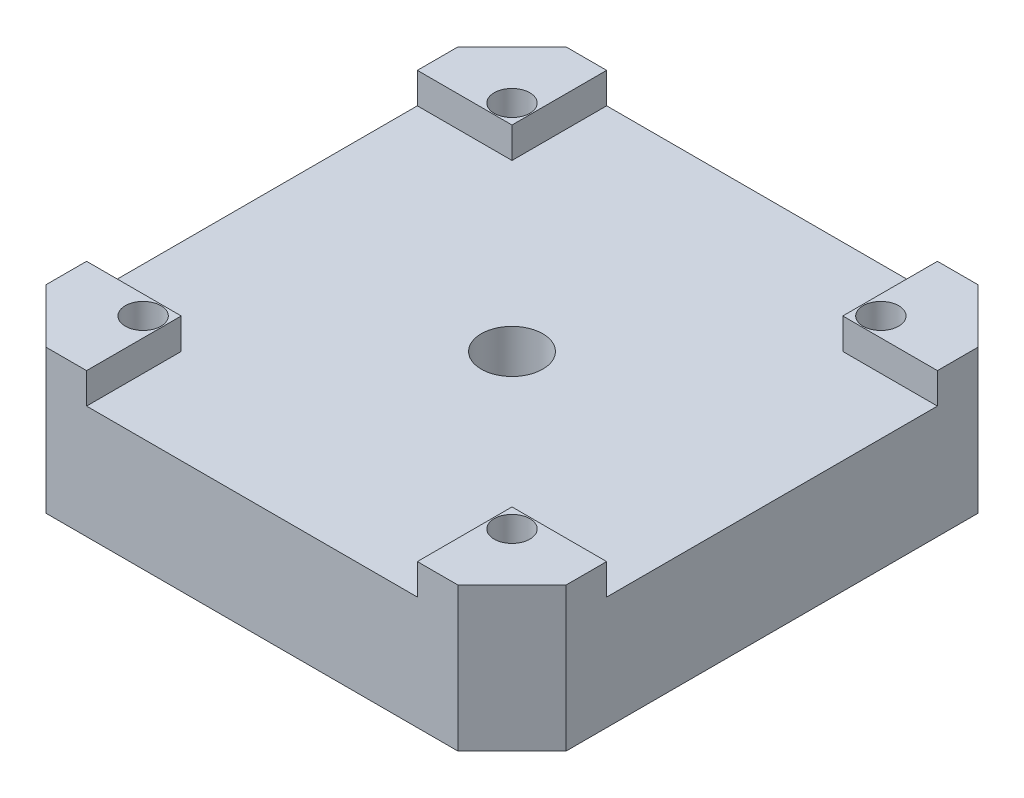
ISO-10303-21;
HEADER;
FILE_DESCRIPTION(('STEP AP214'),'2;1');
FILE_NAME('part.step','',(''),(''),'','','');
FILE_SCHEMA(('AUTOMOTIVE_DESIGN { 1 0 10303 214 1 1 1 1 }'));
ENDSEC;
DATA;
#1=APPLICATION_CONTEXT('core data for automotive mechanical design processes');
#2=APPLICATION_PROTOCOL_DEFINITION('international standard','automotive_design',2000,#1);
#3=PRODUCT_CONTEXT('',#1,'mechanical');
#4=PRODUCT('Part','Part','',(#3));
#5=PRODUCT_RELATED_PRODUCT_CATEGORY('part','',(#4));
#6=PRODUCT_DEFINITION_FORMATION('','',#4);
#7=PRODUCT_DEFINITION_CONTEXT('part definition',#1,'design');
#8=PRODUCT_DEFINITION('design','',#6,#7);
#9=PRODUCT_DEFINITION_SHAPE('','',#8);
#10=(LENGTH_UNIT() NAMED_UNIT(*) SI_UNIT(.MILLI.,.METRE.));
#11=(NAMED_UNIT(*) PLANE_ANGLE_UNIT() SI_UNIT($,.RADIAN.));
#12=(NAMED_UNIT(*) SI_UNIT($,.STERADIAN.) SOLID_ANGLE_UNIT());
#13=UNCERTAINTY_MEASURE_WITH_UNIT(LENGTH_MEASURE(1.E-05),#10,'distance_accuracy_value','');
#14=(GEOMETRIC_REPRESENTATION_CONTEXT(3) GLOBAL_UNCERTAINTY_ASSIGNED_CONTEXT((#13)) GLOBAL_UNIT_ASSIGNED_CONTEXT((#10,
#11,#12)) REPRESENTATION_CONTEXT('',''));
#15=CARTESIAN_POINT('',(0.,0.,0.));
#16=DIRECTION('',(0.,0.,1.));
#17=DIRECTION('',(1.,0.,0.));
#18=AXIS2_PLACEMENT_3D('',#15,#16,#17);
#19=CARTESIAN_POINT('',(0.,11.7,0.));
#20=DIRECTION('',(0.,-1.,0.));
#21=DIRECTION('',(0.,0.,-1.));
#22=AXIS2_PLACEMENT_3D('',#19,#20,#21);
#23=PLANE('',#22);
#24=CARTESIAN_POINT('',(15.,11.7,-15.));
#25=DIRECTION('',(0.,-1.,0.));
#26=DIRECTION('',(0.,0.,-1.));
#27=AXIS2_PLACEMENT_3D('',#24,#25,#26);
#28=CIRCLE('',#27,1.45);
#29=CARTESIAN_POINT('',(15.,11.7,-16.45));
#30=VERTEX_POINT('',#29);
#31=EDGE_CURVE('E365',#30,#30,#28,.T.);
#32=ORIENTED_EDGE('',*,*,#31,.T.);
#33=EDGE_LOOP('',(#32));
#34=FACE_BOUND('',#33,.T.);
#35=DIRECTION('',(-1.,0.,0.));
#36=VECTOR('',#35,1.);
#37=CARTESIAN_POINT('',(-16.750923471599,11.7,-21.15));
#38=LINE('',#37,#36);
#39=CARTESIAN_POINT('',(16.750923471599,11.7,-21.15));
#40=VERTEX_POINT('',#39);
#41=CARTESIAN_POINT('',(13.450923471599,11.7,-21.15));
#42=VERTEX_POINT('',#41);
#43=EDGE_CURVE('E194',#40,#42,#38,.T.);
#44=ORIENTED_EDGE('',*,*,#43,.T.);
#45=DIRECTION('',(0.,0.,1.));
#46=VECTOR('',#45,1.);
#47=CARTESIAN_POINT('',(13.450923471599,11.7,-21.15));
#48=LINE('',#47,#46);
#49=CARTESIAN_POINT('',(13.450923471599,11.7,-13.4509234715989));
#50=VERTEX_POINT('',#49);
#51=EDGE_CURVE('E302',#42,#50,#48,.T.);
#52=ORIENTED_EDGE('',*,*,#51,.T.);
#53=DIRECTION('',(1.,0.,0.));
#54=VECTOR('',#53,1.);
#55=CARTESIAN_POINT('',(-21.15,11.7,-13.4509234715989));
#56=LINE('',#55,#54);
#57=CARTESIAN_POINT('',(21.15,11.7,-13.4509234715989));
#58=VERTEX_POINT('',#57);
#59=EDGE_CURVE('E288',#50,#58,#56,.T.);
#60=ORIENTED_EDGE('',*,*,#59,.T.);
#61=DIRECTION('',(0.,0.,-1.));
#62=VECTOR('',#61,1.);
#63=CARTESIAN_POINT('',(21.15,11.7,16.7509234715989));
#64=LINE('',#63,#62);
#65=CARTESIAN_POINT('',(21.15,11.7,-16.7509234715989));
#66=VERTEX_POINT('',#65);
#67=EDGE_CURVE('E276',#58,#66,#64,.T.);
#68=ORIENTED_EDGE('',*,*,#67,.T.);
#69=DIRECTION('',(-0.707106781186542,0.,-0.707106781186553));
#70=VECTOR('',#69,1.);
#71=CARTESIAN_POINT('',(16.750923471599,11.7,-21.15));
#72=LINE('',#71,#70);
#73=EDGE_CURVE('E195',#66,#40,#72,.T.);
#74=ORIENTED_EDGE('',*,*,#73,.T.);
#75=EDGE_LOOP('',(#44,#52,#60,#68,#74));
#76=FACE_BOUND('',#75,.T.);
#77=ADVANCED_FACE('F35',(#34,#76),#23,.F.);
#78=CARTESIAN_POINT('',(15.,11.7,15.));
#79=DIRECTION('',(0.,-1.,0.));
#80=DIRECTION('',(0.,0.,-1.));
#81=AXIS2_PLACEMENT_3D('',#78,#79,#80);
#82=CIRCLE('',#81,1.45);
#83=CARTESIAN_POINT('',(15.,11.7,13.55));
#84=VERTEX_POINT('',#83);
#85=EDGE_CURVE('E377',#84,#84,#82,.T.);
#86=ORIENTED_EDGE('',*,*,#85,.T.);
#87=EDGE_LOOP('',(#86));
#88=FACE_BOUND('',#87,.T.);
#89=DIRECTION('',(1.,0.,0.));
#90=VECTOR('',#89,1.);
#91=CARTESIAN_POINT('',(-21.15,11.7,13.4509234715989));
#92=LINE('',#91,#90);
#93=CARTESIAN_POINT('',(13.450923471599,11.7,13.4509234715989));
#94=VERTEX_POINT('',#93);
#95=CARTESIAN_POINT('',(21.15,11.7,13.4509234715989));
#96=VERTEX_POINT('',#95);
#97=EDGE_CURVE('E266',#94,#96,#92,.T.);
#98=ORIENTED_EDGE('',*,*,#97,.F.);
#99=CARTESIAN_POINT('',(13.450923471599,11.7,21.15));
#100=VERTEX_POINT('',#99);
#101=EDGE_CURVE('E305',#94,#100,#48,.T.);
#102=ORIENTED_EDGE('',*,*,#101,.T.);
#103=DIRECTION('',(1.,0.,0.));
#104=VECTOR('',#103,1.);
#105=CARTESIAN_POINT('',(-16.750923471599,11.7,21.15));
#106=LINE('',#105,#104);
#107=CARTESIAN_POINT('',(16.750923471599,11.7,21.15));
#108=VERTEX_POINT('',#107);
#109=EDGE_CURVE('E271',#100,#108,#106,.T.);
#110=ORIENTED_EDGE('',*,*,#109,.T.);
#111=DIRECTION('',(0.707106781186546,0.,-0.707106781186549));
#112=VECTOR('',#111,1.);
#113=CARTESIAN_POINT('',(16.750923471599,11.7,21.15));
#114=LINE('',#113,#112);
#115=CARTESIAN_POINT('',(21.15,11.7,16.7509234715989));
#116=VERTEX_POINT('',#115);
#117=EDGE_CURVE('E275',#108,#116,#114,.T.);
#118=ORIENTED_EDGE('',*,*,#117,.T.);
#119=EDGE_CURVE('E199',#116,#96,#64,.T.);
#120=ORIENTED_EDGE('',*,*,#119,.T.);
#121=EDGE_LOOP('',(#98,#102,#110,#118,#120));
#122=FACE_BOUND('',#121,.T.);
#123=ADVANCED_FACE('F438',(#88,#122),#23,.F.);
#124=CARTESIAN_POINT('',(-21.15,9.2,-13.4509234715989));
#125=DIRECTION('',(0.,0.,-1.));
#126=DIRECTION('',(-1.,0.,0.));
#127=AXIS2_PLACEMENT_3D('',#124,#125,#126);
#128=PLANE('',#127);
#129=ORIENTED_EDGE('',*,*,#59,.F.);
#130=DIRECTION('',(0.,-1.,0.));
#131=VECTOR('',#130,1.);
#132=CARTESIAN_POINT('',(13.450923471599,9.20000000000002,-13.4509234715989));
#133=LINE('',#132,#131);
#134=CARTESIAN_POINT('',(13.450923471599,9.2,-13.4509234715989));
#135=VERTEX_POINT('',#134);
#136=EDGE_CURVE('E310',#50,#135,#133,.T.);
#137=ORIENTED_EDGE('',*,*,#136,.T.);
#138=DIRECTION('',(1.,0.,0.));
#139=VECTOR('',#138,1.);
#140=CARTESIAN_POINT('',(-21.15,9.2,-13.4509234715989));
#141=LINE('',#140,#139);
#142=CARTESIAN_POINT('',(21.15,9.2,-13.4509234715989));
#143=VERTEX_POINT('',#142);
#144=EDGE_CURVE('E258',#135,#143,#141,.T.);
#145=ORIENTED_EDGE('',*,*,#144,.T.);
#146=DIRECTION('',(0.,1.,0.));
#147=VECTOR('',#146,1.);
#148=CARTESIAN_POINT('',(21.15,9.2,-13.4509234715989));
#149=LINE('',#148,#147);
#150=EDGE_CURVE('E312',#143,#58,#149,.T.);
#151=ORIENTED_EDGE('',*,*,#150,.T.);
#152=EDGE_LOOP('',(#129,#137,#145,#151));
#153=FACE_BOUND('',#152,.T.);
#154=ADVANCED_FACE('F309',(#153),#128,.F.);
#155=CARTESIAN_POINT('',(-21.15,11.7,13.4509234715989));
#156=DIRECTION('',(0.,0.,1.));
#157=DIRECTION('',(1.,0.,0.));
#158=AXIS2_PLACEMENT_3D('',#155,#156,#157);
#159=PLANE('',#158);
#160=DIRECTION('',(1.,0.,0.));
#161=VECTOR('',#160,1.);
#162=CARTESIAN_POINT('',(-21.15,9.2,13.4509234715989));
#163=LINE('',#162,#161);
#164=CARTESIAN_POINT('',(13.450923471599,9.2,13.4509234715989));
#165=VERTEX_POINT('',#164);
#166=CARTESIAN_POINT('',(21.15,9.2,13.4509234715989));
#167=VERTEX_POINT('',#166);
#168=EDGE_CURVE('E259',#165,#167,#163,.T.);
#169=ORIENTED_EDGE('',*,*,#168,.F.);
#170=DIRECTION('',(0.,1.,0.));
#171=VECTOR('',#170,1.);
#172=CARTESIAN_POINT('',(13.450923471599,11.7,13.4509234715989));
#173=LINE('',#172,#171);
#174=EDGE_CURVE('E11',#165,#94,#173,.T.);
#175=ORIENTED_EDGE('',*,*,#174,.T.);
#176=ORIENTED_EDGE('',*,*,#97,.T.);
#177=DIRECTION('',(0.,-1.,0.));
#178=VECTOR('',#177,1.);
#179=CARTESIAN_POINT('',(21.15,11.7,13.4509234715989));
#180=LINE('',#179,#178);
#181=EDGE_CURVE('E320',#96,#167,#180,.T.);
#182=ORIENTED_EDGE('',*,*,#181,.T.);
#183=EDGE_LOOP('',(#169,#175,#176,#182));
#184=FACE_BOUND('',#183,.T.);
#185=ADVANCED_FACE('F448',(#184),#159,.F.);
#186=CARTESIAN_POINT('',(-15.,11.7,-15.));
#187=DIRECTION('',(0.,-1.,0.));
#188=DIRECTION('',(0.,0.,-1.));
#189=AXIS2_PLACEMENT_3D('',#186,#187,#188);
#190=CIRCLE('',#189,1.45);
#191=CARTESIAN_POINT('',(-15.,11.7,-16.45));
#192=VERTEX_POINT('',#191);
#193=EDGE_CURVE('E353',#192,#192,#190,.T.);
#194=ORIENTED_EDGE('',*,*,#193,.T.);
#195=EDGE_LOOP('',(#194));
#196=FACE_BOUND('',#195,.T.);
#197=CARTESIAN_POINT('',(-21.15,11.7,-13.4509234715989));
#198=VERTEX_POINT('',#197);
#199=CARTESIAN_POINT('',(-13.450923471599,11.7,-13.4509234715989));
#200=VERTEX_POINT('',#199);
#201=EDGE_CURVE('E187',#198,#200,#56,.T.);
#202=ORIENTED_EDGE('',*,*,#201,.T.);
#203=DIRECTION('',(0.,0.,1.));
#204=VECTOR('',#203,1.);
#205=CARTESIAN_POINT('',(-13.450923471599,11.7,-21.15));
#206=LINE('',#205,#204);
#207=CARTESIAN_POINT('',(-13.450923471599,11.7,-21.15));
#208=VERTEX_POINT('',#207);
#209=EDGE_CURVE('E50',#208,#200,#206,.T.);
#210=ORIENTED_EDGE('',*,*,#209,.F.);
#211=CARTESIAN_POINT('',(-16.750923471599,11.7,-21.15));
#212=VERTEX_POINT('',#211);
#213=EDGE_CURVE('E184',#208,#212,#38,.T.);
#214=ORIENTED_EDGE('',*,*,#213,.T.);
#215=DIRECTION('',(-0.707106781186546,0.,0.707106781186549));
#216=VECTOR('',#215,1.);
#217=CARTESIAN_POINT('',(-21.15,11.7,-16.7509234715989));
#218=LINE('',#217,#216);
#219=CARTESIAN_POINT('',(-21.15,11.7,-16.7509234715989));
#220=VERTEX_POINT('',#219);
#221=EDGE_CURVE('E198',#212,#220,#218,.T.);
#222=ORIENTED_EDGE('',*,*,#221,.T.);
#223=DIRECTION('',(0.,0.,1.));
#224=VECTOR('',#223,1.);
#225=CARTESIAN_POINT('',(-21.15,11.7,16.7509234715989));
#226=LINE('',#225,#224);
#227=EDGE_CURVE('E267',#220,#198,#226,.T.);
#228=ORIENTED_EDGE('',*,*,#227,.T.);
#229=EDGE_LOOP('',(#202,#210,#214,#222,#228));
#230=FACE_BOUND('',#229,.T.);
#231=ADVANCED_FACE('F183',(#196,#230),#23,.F.);
#232=CARTESIAN_POINT('',(-21.15,11.7,16.7509234715989));
#233=DIRECTION('',(1.,0.,0.));
#234=DIRECTION('',(0.,0.,-1.));
#235=AXIS2_PLACEMENT_3D('',#232,#233,#234);
#236=PLANE('',#235);
#237=DIRECTION('',(0.,0.,-1.));
#238=VECTOR('',#237,1.);
#239=CARTESIAN_POINT('',(-21.15,9.2,13.4509234715989));
#240=LINE('',#239,#238);
#241=CARTESIAN_POINT('',(-21.15,9.2,13.4509234715989));
#242=VERTEX_POINT('',#241);
#243=CARTESIAN_POINT('',(-21.15,9.2,-13.4509234715989));
#244=VERTEX_POINT('',#243);
#245=EDGE_CURVE('E256',#242,#244,#240,.T.);
#246=ORIENTED_EDGE('',*,*,#245,.T.);
#247=DIRECTION('',(0.,1.,0.));
#248=VECTOR('',#247,1.);
#249=CARTESIAN_POINT('',(-21.15,9.2,-13.4509234715989));
#250=LINE('',#249,#248);
#251=EDGE_CURVE('E323',#244,#198,#250,.T.);
#252=ORIENTED_EDGE('',*,*,#251,.T.);
#253=ORIENTED_EDGE('',*,*,#227,.F.);
#254=DIRECTION('',(0.,-1.,0.));
#255=VECTOR('',#254,1.);
#256=CARTESIAN_POINT('',(-21.15,11.7,-16.7509234715989));
#257=LINE('',#256,#255);
#258=CARTESIAN_POINT('',(-21.15,0.,-16.7509234715989));
#259=VERTEX_POINT('',#258);
#260=EDGE_CURVE('E204',#220,#259,#257,.T.);
#261=ORIENTED_EDGE('',*,*,#260,.T.);
#262=DIRECTION('',(0.,0.,1.));
#263=VECTOR('',#262,1.);
#264=CARTESIAN_POINT('',(-21.15,0.,16.7509234715989));
#265=LINE('',#264,#263);
#266=CARTESIAN_POINT('',(-21.15,0.,16.7509234715989));
#267=VERTEX_POINT('',#266);
#268=EDGE_CURVE('E205',#259,#267,#265,.T.);
#269=ORIENTED_EDGE('',*,*,#268,.T.);
#270=DIRECTION('',(0.,-1.,0.));
#271=VECTOR('',#270,1.);
#272=CARTESIAN_POINT('',(-21.15,11.7,16.7509234715989));
#273=LINE('',#272,#271);
#274=CARTESIAN_POINT('',(-21.15,11.7,16.7509234715989));
#275=VERTEX_POINT('',#274);
#276=EDGE_CURVE('E241',#275,#267,#273,.T.);
#277=ORIENTED_EDGE('',*,*,#276,.F.);
#278=CARTESIAN_POINT('',(-21.15,11.7,13.4509234715989));
#279=VERTEX_POINT('',#278);
#280=EDGE_CURVE('E222',#279,#275,#226,.T.);
#281=ORIENTED_EDGE('',*,*,#280,.F.);
#282=DIRECTION('',(0.,-1.,0.));
#283=VECTOR('',#282,1.);
#284=CARTESIAN_POINT('',(-21.15,11.7,13.4509234715989));
#285=LINE('',#284,#283);
#286=EDGE_CURVE('E316',#279,#242,#285,.T.);
#287=ORIENTED_EDGE('',*,*,#286,.T.);
#288=EDGE_LOOP('',(#246,#252,#253,#261,#269,#277,#281,#287));
#289=FACE_BOUND('',#288,.T.);
#290=ADVANCED_FACE('F37',(#289),#236,.F.);
#291=CARTESIAN_POINT('',(-21.15,11.7,16.7509234715989));
#292=DIRECTION('',(0.707106781186553,0.,-0.707106781186542));
#293=DIRECTION('',(-0.707106781186542,0.,-0.707106781186553));
#294=AXIS2_PLACEMENT_3D('',#291,#292,#293);
#295=PLANE('',#294);
#296=DIRECTION('',(0.707106781186542,0.,0.707106781186553));
#297=VECTOR('',#296,1.);
#298=CARTESIAN_POINT('',(-21.15,0.,16.7509234715989));
#299=LINE('',#298,#297);
#300=CARTESIAN_POINT('',(-16.750923471599,0.,21.15));
#301=VERTEX_POINT('',#300);
#302=EDGE_CURVE('E208',#267,#301,#299,.T.);
#303=ORIENTED_EDGE('',*,*,#302,.T.);
#304=DIRECTION('',(0.,-1.,0.));
#305=VECTOR('',#304,1.);
#306=CARTESIAN_POINT('',(-16.750923471599,11.7,21.15));
#307=LINE('',#306,#305);
#308=CARTESIAN_POINT('',(-16.750923471599,11.7,21.15));
#309=VERTEX_POINT('',#308);
#310=EDGE_CURVE('E238',#309,#301,#307,.T.);
#311=ORIENTED_EDGE('',*,*,#310,.F.);
#312=DIRECTION('',(0.707106781186542,0.,0.707106781186553));
#313=VECTOR('',#312,1.);
#314=CARTESIAN_POINT('',(-21.15,11.7,16.7509234715989));
#315=LINE('',#314,#313);
#316=EDGE_CURVE('E269',#275,#309,#315,.T.);
#317=ORIENTED_EDGE('',*,*,#316,.F.);
#318=ORIENTED_EDGE('',*,*,#276,.T.);
#319=EDGE_LOOP('',(#303,#311,#317,#318));
#320=FACE_BOUND('',#319,.T.);
#321=ADVANCED_FACE('F721',(#320),#295,.F.);
#322=CARTESIAN_POINT('',(-16.750923471599,11.7,21.15));
#323=DIRECTION('',(0.,0.,-1.));
#324=DIRECTION('',(-1.,0.,0.));
#325=AXIS2_PLACEMENT_3D('',#322,#323,#324);
#326=PLANE('',#325);
#327=ORIENTED_EDGE('',*,*,#109,.F.);
#328=DIRECTION('',(0.,1.,0.));
#329=VECTOR('',#328,1.);
#330=CARTESIAN_POINT('',(13.450923471599,9.2,21.15));
#331=LINE('',#330,#329);
#332=CARTESIAN_POINT('',(13.450923471599,9.2,21.15));
#333=VERTEX_POINT('',#332);
#334=EDGE_CURVE('E179',#333,#100,#331,.T.);
#335=ORIENTED_EDGE('',*,*,#334,.F.);
#336=DIRECTION('',(1.,0.,0.));
#337=VECTOR('',#336,1.);
#338=CARTESIAN_POINT('',(-13.450923471599,9.2,21.15));
#339=LINE('',#338,#337);
#340=CARTESIAN_POINT('',(-13.450923471599,9.2,21.15));
#341=VERTEX_POINT('',#340);
#342=EDGE_CURVE('E335',#341,#333,#339,.T.);
#343=ORIENTED_EDGE('',*,*,#342,.F.);
#344=DIRECTION('',(0.,-1.,0.));
#345=VECTOR('',#344,1.);
#346=CARTESIAN_POINT('',(-13.450923471599,11.7,21.15));
#347=LINE('',#346,#345);
#348=CARTESIAN_POINT('',(-13.450923471599,11.7,21.15));
#349=VERTEX_POINT('',#348);
#350=EDGE_CURVE('E337',#349,#341,#347,.T.);
#351=ORIENTED_EDGE('',*,*,#350,.F.);
#352=EDGE_CURVE('E272',#309,#349,#106,.T.);
#353=ORIENTED_EDGE('',*,*,#352,.F.);
#354=ORIENTED_EDGE('',*,*,#310,.T.);
#355=DIRECTION('',(1.,0.,0.));
#356=VECTOR('',#355,1.);
#357=CARTESIAN_POINT('',(-16.750923471599,0.,21.15));
#358=LINE('',#357,#356);
#359=CARTESIAN_POINT('',(16.750923471599,0.,21.15));
#360=VERTEX_POINT('',#359);
#361=EDGE_CURVE('E210',#301,#360,#358,.T.);
#362=ORIENTED_EDGE('',*,*,#361,.T.);
#363=DIRECTION('',(0.,-1.,0.));
#364=VECTOR('',#363,1.);
#365=CARTESIAN_POINT('',(16.750923471599,11.7,21.15));
#366=LINE('',#365,#364);
#367=EDGE_CURVE('E235',#108,#360,#366,.T.);
#368=ORIENTED_EDGE('',*,*,#367,.F.);
#369=EDGE_LOOP('',(#327,#335,#343,#351,#353,#354,#362,#368));
#370=FACE_BOUND('',#369,.T.);
#371=ADVANCED_FACE('F740',(#370),#326,.F.);
#372=CARTESIAN_POINT('',(16.750923471599,11.7,21.15));
#373=DIRECTION('',(-0.707106781186549,0.,-0.707106781186546));
#374=DIRECTION('',(-0.707106781186546,0.,0.707106781186549));
#375=AXIS2_PLACEMENT_3D('',#372,#373,#374);
#376=PLANE('',#375);
#377=DIRECTION('',(0.707106781186546,0.,-0.707106781186549));
#378=VECTOR('',#377,1.);
#379=CARTESIAN_POINT('',(16.750923471599,0.,21.15));
#380=LINE('',#379,#378);
#381=CARTESIAN_POINT('',(21.15,0.,16.7509234715989));
#382=VERTEX_POINT('',#381);
#383=EDGE_CURVE('E212',#360,#382,#380,.T.);
#384=ORIENTED_EDGE('',*,*,#383,.T.);
#385=DIRECTION('',(0.,-1.,0.));
#386=VECTOR('',#385,1.);
#387=CARTESIAN_POINT('',(21.15,11.7,16.7509234715989));
#388=LINE('',#387,#386);
#389=EDGE_CURVE('E232',#116,#382,#388,.T.);
#390=ORIENTED_EDGE('',*,*,#389,.F.);
#391=ORIENTED_EDGE('',*,*,#117,.F.);
#392=ORIENTED_EDGE('',*,*,#367,.T.);
#393=EDGE_LOOP('',(#384,#390,#391,#392));
#394=FACE_BOUND('',#393,.T.);
#395=ADVANCED_FACE('F710',(#394),#376,.F.);
#396=CARTESIAN_POINT('',(21.15,11.7,16.7509234715989));
#397=DIRECTION('',(-1.,0.,0.));
#398=DIRECTION('',(0.,0.,1.));
#399=AXIS2_PLACEMENT_3D('',#396,#397,#398);
#400=PLANE('',#399);
#401=ORIENTED_EDGE('',*,*,#67,.F.);
#402=ORIENTED_EDGE('',*,*,#150,.F.);
#403=DIRECTION('',(0.,0.,-1.));
#404=VECTOR('',#403,1.);
#405=CARTESIAN_POINT('',(21.15,9.2,13.4509234715989));
#406=LINE('',#405,#404);
#407=EDGE_CURVE('E317',#167,#143,#406,.T.);
#408=ORIENTED_EDGE('',*,*,#407,.F.);
#409=ORIENTED_EDGE('',*,*,#181,.F.);
#410=ORIENTED_EDGE('',*,*,#119,.F.);
#411=ORIENTED_EDGE('',*,*,#389,.T.);
#412=DIRECTION('',(0.,0.,-1.));
#413=VECTOR('',#412,1.);
#414=CARTESIAN_POINT('',(21.15,0.,16.7509234715989));
#415=LINE('',#414,#413);
#416=CARTESIAN_POINT('',(21.15,0.,-16.7509234715989));
#417=VERTEX_POINT('',#416);
#418=EDGE_CURVE('E214',#382,#417,#415,.T.);
#419=ORIENTED_EDGE('',*,*,#418,.T.);
#420=DIRECTION('',(0.,-1.,0.));
#421=VECTOR('',#420,1.);
#422=CARTESIAN_POINT('',(21.15,11.7,-16.7509234715989));
#423=LINE('',#422,#421);
#424=EDGE_CURVE('E229',#66,#417,#423,.T.);
#425=ORIENTED_EDGE('',*,*,#424,.F.);
#426=EDGE_LOOP('',(#401,#402,#408,#409,#410,#411,#419,#425));
#427=FACE_BOUND('',#426,.T.);
#428=ADVANCED_FACE('F292',(#427),#400,.F.);
#429=CARTESIAN_POINT('',(16.750923471599,11.7,-21.15));
#430=DIRECTION('',(-0.707106781186553,0.,0.707106781186542));
#431=DIRECTION('',(0.707106781186542,0.,0.707106781186553));
#432=AXIS2_PLACEMENT_3D('',#429,#430,#431);
#433=PLANE('',#432);
#434=DIRECTION('',(-0.707106781186542,0.,-0.707106781186553));
#435=VECTOR('',#434,1.);
#436=CARTESIAN_POINT('',(16.750923471599,0.,-21.15));
#437=LINE('',#436,#435);
#438=CARTESIAN_POINT('',(16.750923471599,0.,-21.15));
#439=VERTEX_POINT('',#438);
#440=EDGE_CURVE('E216',#417,#439,#437,.T.);
#441=ORIENTED_EDGE('',*,*,#440,.T.);
#442=DIRECTION('',(0.,-1.,0.));
#443=VECTOR('',#442,1.);
#444=CARTESIAN_POINT('',(16.750923471599,11.7,-21.15));
#445=LINE('',#444,#443);
#446=EDGE_CURVE('E226',#40,#439,#445,.T.);
#447=ORIENTED_EDGE('',*,*,#446,.F.);
#448=ORIENTED_EDGE('',*,*,#73,.F.);
#449=ORIENTED_EDGE('',*,*,#424,.T.);
#450=EDGE_LOOP('',(#441,#447,#448,#449));
#451=FACE_BOUND('',#450,.T.);
#452=ADVANCED_FACE('F296',(#451),#433,.F.);
#453=CARTESIAN_POINT('',(-16.750923471599,11.7,-21.15));
#454=DIRECTION('',(0.,0.,1.));
#455=DIRECTION('',(1.,0.,0.));
#456=AXIS2_PLACEMENT_3D('',#453,#454,#455);
#457=PLANE('',#456);
#458=DIRECTION('',(1.,0.,0.));
#459=VECTOR('',#458,1.);
#460=CARTESIAN_POINT('',(-13.450923471599,9.2,-21.15));
#461=LINE('',#460,#459);
#462=CARTESIAN_POINT('',(-13.450923471599,9.2,-21.15));
#463=VERTEX_POINT('',#462);
#464=CARTESIAN_POINT('',(13.450923471599,9.2,-21.15));
#465=VERTEX_POINT('',#464);
#466=EDGE_CURVE('E178',#463,#465,#461,.T.);
#467=ORIENTED_EDGE('',*,*,#466,.T.);
#468=DIRECTION('',(0.,1.,0.));
#469=VECTOR('',#468,1.);
#470=CARTESIAN_POINT('',(13.450923471599,9.2,-21.15));
#471=LINE('',#470,#469);
#472=EDGE_CURVE('E301',#465,#42,#471,.T.);
#473=ORIENTED_EDGE('',*,*,#472,.T.);
#474=ORIENTED_EDGE('',*,*,#43,.F.);
#475=ORIENTED_EDGE('',*,*,#446,.T.);
#476=DIRECTION('',(-1.,0.,0.));
#477=VECTOR('',#476,1.);
#478=CARTESIAN_POINT('',(-16.750923471599,0.,-21.15));
#479=LINE('',#478,#477);
#480=CARTESIAN_POINT('',(-16.750923471599,0.,-21.15));
#481=VERTEX_POINT('',#480);
#482=EDGE_CURVE('E218',#439,#481,#479,.T.);
#483=ORIENTED_EDGE('',*,*,#482,.T.);
#484=DIRECTION('',(0.,-1.,0.));
#485=VECTOR('',#484,1.);
#486=CARTESIAN_POINT('',(-16.750923471599,11.7,-21.15));
#487=LINE('',#486,#485);
#488=EDGE_CURVE('E192',#212,#481,#487,.T.);
#489=ORIENTED_EDGE('',*,*,#488,.F.);
#490=ORIENTED_EDGE('',*,*,#213,.F.);
#491=DIRECTION('',(0.,-1.,0.));
#492=VECTOR('',#491,1.);
#493=CARTESIAN_POINT('',(-13.450923471599,11.7,-21.15));
#494=LINE('',#493,#492);
#495=EDGE_CURVE('E170',#208,#463,#494,.T.);
#496=ORIENTED_EDGE('',*,*,#495,.T.);
#497=EDGE_LOOP('',(#467,#473,#474,#475,#483,#489,#490,#496));
#498=FACE_BOUND('',#497,.T.);
#499=ADVANCED_FACE('F190',(#498),#457,.F.);
#500=CARTESIAN_POINT('',(-21.15,11.7,-16.7509234715989));
#501=DIRECTION('',(0.707106781186549,0.,0.707106781186546));
#502=DIRECTION('',(0.707106781186546,0.,-0.707106781186549));
#503=AXIS2_PLACEMENT_3D('',#500,#501,#502);
#504=PLANE('',#503);
#505=DIRECTION('',(-0.707106781186546,0.,0.707106781186549));
#506=VECTOR('',#505,1.);
#507=CARTESIAN_POINT('',(-21.15,0.,-16.7509234715989));
#508=LINE('',#507,#506);
#509=EDGE_CURVE('E220',#481,#259,#508,.T.);
#510=ORIENTED_EDGE('',*,*,#509,.T.);
#511=ORIENTED_EDGE('',*,*,#260,.F.);
#512=ORIENTED_EDGE('',*,*,#221,.F.);
#513=ORIENTED_EDGE('',*,*,#488,.T.);
#514=EDGE_LOOP('',(#510,#511,#512,#513));
#515=FACE_BOUND('',#514,.T.);
#516=ADVANCED_FACE('F427',(#515),#504,.F.);
#517=CARTESIAN_POINT('',(-15.,11.7,15.));
#518=DIRECTION('',(0.,-1.,0.));
#519=DIRECTION('',(0.,0.,-1.));
#520=AXIS2_PLACEMENT_3D('',#517,#518,#519);
#521=CIRCLE('',#520,1.45);
#522=CARTESIAN_POINT('',(-15.,11.7,13.55));
#523=VERTEX_POINT('',#522);
#524=EDGE_CURVE('E389',#523,#523,#521,.T.);
#525=ORIENTED_EDGE('',*,*,#524,.T.);
#526=EDGE_LOOP('',(#525));
#527=FACE_BOUND('',#526,.T.);
#528=ORIENTED_EDGE('',*,*,#352,.T.);
#529=CARTESIAN_POINT('',(-13.450923471599,11.7,13.4509234715989));
#530=VERTEX_POINT('',#529);
#531=EDGE_CURVE('E188',#530,#349,#206,.T.);
#532=ORIENTED_EDGE('',*,*,#531,.F.);
#533=EDGE_CURVE('E250',#279,#530,#92,.T.);
#534=ORIENTED_EDGE('',*,*,#533,.F.);
#535=ORIENTED_EDGE('',*,*,#280,.T.);
#536=ORIENTED_EDGE('',*,*,#316,.T.);
#537=EDGE_LOOP('',(#528,#532,#534,#535,#536));
#538=FACE_BOUND('',#537,.T.);
#539=ADVANCED_FACE('F408',(#527,#538),#23,.F.);
#540=CARTESIAN_POINT('',(0.,0.,0.));
#541=DIRECTION('',(0.,-1.,0.));
#542=DIRECTION('',(0.,0.,-1.));
#543=AXIS2_PLACEMENT_3D('',#540,#541,#542);
#544=PLANE('',#543);
#545=CARTESIAN_POINT('',(-15.,0.,15.));
#546=DIRECTION('',(0.,-1.,0.));
#547=DIRECTION('',(0.,0.,-1.));
#548=AXIS2_PLACEMENT_3D('',#545,#546,#547);
#549=CIRCLE('',#548,3.);
#550=CARTESIAN_POINT('',(-15.,0.,12.));
#551=VERTEX_POINT('',#550);
#552=EDGE_CURVE('E398',#551,#551,#549,.T.);
#553=ORIENTED_EDGE('',*,*,#552,.F.);
#554=EDGE_LOOP('',(#553));
#555=FACE_BOUND('',#554,.T.);
#556=CARTESIAN_POINT('',(15.,0.,15.));
#557=DIRECTION('',(0.,-1.,0.));
#558=DIRECTION('',(0.,0.,-1.));
#559=AXIS2_PLACEMENT_3D('',#556,#557,#558);
#560=CIRCLE('',#559,3.);
#561=CARTESIAN_POINT('',(15.,0.,12.));
#562=VERTEX_POINT('',#561);
#563=EDGE_CURVE('E386',#562,#562,#560,.T.);
#564=ORIENTED_EDGE('',*,*,#563,.F.);
#565=EDGE_LOOP('',(#564));
#566=FACE_BOUND('',#565,.T.);
#567=CARTESIAN_POINT('',(15.,0.,-15.));
#568=DIRECTION('',(0.,-1.,0.));
#569=DIRECTION('',(0.,0.,-1.));
#570=AXIS2_PLACEMENT_3D('',#567,#568,#569);
#571=CIRCLE('',#570,3.);
#572=CARTESIAN_POINT('',(15.,0.,-18.));
#573=VERTEX_POINT('',#572);
#574=EDGE_CURVE('E374',#573,#573,#571,.T.);
#575=ORIENTED_EDGE('',*,*,#574,.F.);
#576=EDGE_LOOP('',(#575));
#577=FACE_BOUND('',#576,.T.);
#578=CARTESIAN_POINT('',(-15.,0.,-15.));
#579=DIRECTION('',(0.,-1.,0.));
#580=DIRECTION('',(0.,0.,-1.));
#581=AXIS2_PLACEMENT_3D('',#578,#579,#580);
#582=CIRCLE('',#581,3.);
#583=CARTESIAN_POINT('',(-15.,0.,-18.));
#584=VERTEX_POINT('',#583);
#585=EDGE_CURVE('E362',#584,#584,#582,.T.);
#586=ORIENTED_EDGE('',*,*,#585,.F.);
#587=EDGE_LOOP('',(#586));
#588=FACE_BOUND('',#587,.T.);
#589=CARTESIAN_POINT('',(0.,0.,0.));
#590=DIRECTION('',(0.,-1.,0.));
#591=DIRECTION('',(0.,0.,-1.));
#592=AXIS2_PLACEMENT_3D('',#589,#590,#591);
#593=CIRCLE('',#592,3.25);
#594=CARTESIAN_POINT('',(0.,0.,-3.25));
#595=VERTEX_POINT('',#594);
#596=EDGE_CURVE('E342',#595,#595,#593,.T.);
#597=ORIENTED_EDGE('',*,*,#596,.F.);
#598=EDGE_LOOP('',(#597));
#599=FACE_BOUND('',#598,.T.);
#600=ORIENTED_EDGE('',*,*,#268,.F.);
#601=ORIENTED_EDGE('',*,*,#509,.F.);
#602=ORIENTED_EDGE('',*,*,#482,.F.);
#603=ORIENTED_EDGE('',*,*,#440,.F.);
#604=ORIENTED_EDGE('',*,*,#418,.F.);
#605=ORIENTED_EDGE('',*,*,#383,.F.);
#606=ORIENTED_EDGE('',*,*,#361,.F.);
#607=ORIENTED_EDGE('',*,*,#302,.F.);
#608=EDGE_LOOP('',(#600,#601,#602,#603,#604,#605,#606,#607));
#609=FACE_BOUND('',#608,.T.);
#610=ADVANCED_FACE('F404',(#555,#566,#577,#588,#599,#609),#544,.T.);
#611=CARTESIAN_POINT('',(-13.450923471599,9.2,-13.4509234715989));
#612=VERTEX_POINT('',#611);
#613=EDGE_CURVE('E261',#244,#612,#141,.T.);
#614=ORIENTED_EDGE('',*,*,#613,.T.);
#615=DIRECTION('',(0.,1.,0.));
#616=VECTOR('',#615,1.);
#617=CARTESIAN_POINT('',(-13.450923471599,9.2,-13.4509234715989));
#618=LINE('',#617,#616);
#619=EDGE_CURVE('E304',#612,#200,#618,.T.);
#620=ORIENTED_EDGE('',*,*,#619,.T.);
#621=ORIENTED_EDGE('',*,*,#201,.F.);
#622=ORIENTED_EDGE('',*,*,#251,.F.);
#623=EDGE_LOOP('',(#614,#620,#621,#622));
#624=FACE_BOUND('',#623,.T.);
#625=ADVANCED_FACE('F407',(#624),#128,.F.);
#626=CARTESIAN_POINT('',(-21.15,9.2,13.4509234715989));
#627=DIRECTION('',(0.,-1.,0.));
#628=DIRECTION('',(0.,0.,-1.));
#629=AXIS2_PLACEMENT_3D('',#626,#627,#628);
#630=PLANE('',#629);
#631=CARTESIAN_POINT('',(0.,9.2,0.));
#632=DIRECTION('',(0.,-1.,0.));
#633=DIRECTION('',(0.,0.,-1.));
#634=AXIS2_PLACEMENT_3D('',#631,#632,#633);
#635=CIRCLE('',#634,2.5);
#636=CARTESIAN_POINT('',(0.,9.2,-2.5));
#637=VERTEX_POINT('',#636);
#638=EDGE_CURVE('E345',#637,#637,#635,.T.);
#639=ORIENTED_EDGE('',*,*,#638,.T.);
#640=EDGE_LOOP('',(#639));
#641=FACE_BOUND('',#640,.T.);
#642=CARTESIAN_POINT('',(-13.450923471599,9.2,13.4509234715989));
#643=VERTEX_POINT('',#642);
#644=EDGE_CURVE('E247',#242,#643,#163,.T.);
#645=ORIENTED_EDGE('',*,*,#644,.T.);
#646=DIRECTION('',(0.,0.,1.));
#647=VECTOR('',#646,1.);
#648=CARTESIAN_POINT('',(-13.450923471599,9.2,-21.15));
#649=LINE('',#648,#647);
#650=EDGE_CURVE('E58',#643,#341,#649,.T.);
#651=ORIENTED_EDGE('',*,*,#650,.T.);
#652=ORIENTED_EDGE('',*,*,#342,.T.);
#653=DIRECTION('',(0.,0.,1.));
#654=VECTOR('',#653,1.);
#655=CARTESIAN_POINT('',(13.450923471599,9.2,-21.15));
#656=LINE('',#655,#654);
#657=EDGE_CURVE('E331',#165,#333,#656,.T.);
#658=ORIENTED_EDGE('',*,*,#657,.F.);
#659=ORIENTED_EDGE('',*,*,#168,.T.);
#660=ORIENTED_EDGE('',*,*,#407,.T.);
#661=ORIENTED_EDGE('',*,*,#144,.F.);
#662=EDGE_CURVE('E332',#465,#135,#656,.T.);
#663=ORIENTED_EDGE('',*,*,#662,.F.);
#664=ORIENTED_EDGE('',*,*,#466,.F.);
#665=EDGE_CURVE('E173',#463,#612,#649,.T.);
#666=ORIENTED_EDGE('',*,*,#665,.T.);
#667=ORIENTED_EDGE('',*,*,#613,.F.);
#668=ORIENTED_EDGE('',*,*,#245,.F.);
#669=EDGE_LOOP('',(#645,#651,#652,#658,#659,#660,#661,#663,#664,#666,#667,#668));
#670=FACE_BOUND('',#669,.T.);
#671=ADVANCED_FACE('F253',(#641,#670),#630,.F.);
#672=ORIENTED_EDGE('',*,*,#533,.T.);
#673=DIRECTION('',(0.,-1.,0.));
#674=VECTOR('',#673,1.);
#675=CARTESIAN_POINT('',(-13.450923471599,11.7,13.4509234715989));
#676=LINE('',#675,#674);
#677=EDGE_CURVE('E43',#530,#643,#676,.T.);
#678=ORIENTED_EDGE('',*,*,#677,.T.);
#679=ORIENTED_EDGE('',*,*,#644,.F.);
#680=ORIENTED_EDGE('',*,*,#286,.F.);
#681=EDGE_LOOP('',(#672,#678,#679,#680));
#682=FACE_BOUND('',#681,.T.);
#683=ADVANCED_FACE('F246',(#682),#159,.F.);
#684=CARTESIAN_POINT('',(-13.450923471599,11.7,-21.15));
#685=DIRECTION('',(-1.,0.,0.));
#686=DIRECTION('',(0.,0.,1.));
#687=AXIS2_PLACEMENT_3D('',#684,#685,#686);
#688=PLANE('',#687);
#689=ORIENTED_EDGE('',*,*,#531,.T.);
#690=ORIENTED_EDGE('',*,*,#350,.T.);
#691=ORIENTED_EDGE('',*,*,#650,.F.);
#692=ORIENTED_EDGE('',*,*,#677,.F.);
#693=EDGE_LOOP('',(#689,#690,#691,#692));
#694=FACE_BOUND('',#693,.T.);
#695=ADVANCED_FACE('F447',(#694),#688,.F.);
#696=CARTESIAN_POINT('',(13.450923471599,9.2,-21.15));
#697=DIRECTION('',(1.,0.,0.));
#698=DIRECTION('',(0.,1.,0.));
#699=AXIS2_PLACEMENT_3D('',#696,#697,#698);
#700=PLANE('',#699);
#701=ORIENTED_EDGE('',*,*,#657,.T.);
#702=ORIENTED_EDGE('',*,*,#334,.T.);
#703=ORIENTED_EDGE('',*,*,#101,.F.);
#704=ORIENTED_EDGE('',*,*,#174,.F.);
#705=EDGE_LOOP('',(#701,#702,#703,#704));
#706=FACE_BOUND('',#705,.T.);
#707=ADVANCED_FACE('F461',(#706),#700,.F.);
#708=ORIENTED_EDGE('',*,*,#51,.F.);
#709=ORIENTED_EDGE('',*,*,#472,.F.);
#710=ORIENTED_EDGE('',*,*,#662,.T.);
#711=ORIENTED_EDGE('',*,*,#136,.F.);
#712=EDGE_LOOP('',(#708,#709,#710,#711));
#713=FACE_BOUND('',#712,.T.);
#714=ADVANCED_FACE('F458',(#713),#700,.F.);
#715=ORIENTED_EDGE('',*,*,#665,.F.);
#716=ORIENTED_EDGE('',*,*,#495,.F.);
#717=ORIENTED_EDGE('',*,*,#209,.T.);
#718=ORIENTED_EDGE('',*,*,#619,.F.);
#719=EDGE_LOOP('',(#715,#716,#717,#718));
#720=FACE_BOUND('',#719,.T.);
#721=ADVANCED_FACE('F171',(#720),#688,.F.);
#722=CARTESIAN_POINT('',(0.,3.,0.));
#723=DIRECTION('',(0.,-1.,0.));
#724=DIRECTION('',(0.,0.,-1.));
#725=AXIS2_PLACEMENT_3D('',#722,#723,#724);
#726=CYLINDRICAL_SURFACE('',#725,3.25);
#727=CARTESIAN_POINT('',(0.,3.,0.));
#728=DIRECTION('',(0.,-1.,0.));
#729=DIRECTION('',(0.,0.,-1.));
#730=AXIS2_PLACEMENT_3D('',#727,#728,#729);
#731=CIRCLE('',#730,3.25);
#732=CARTESIAN_POINT('',(0.,3.,-3.25));
#733=VERTEX_POINT('',#732);
#734=EDGE_CURVE('E339',#733,#733,#731,.T.);
#735=ORIENTED_EDGE('',*,*,#734,.F.);
#736=EDGE_LOOP('',(#735));
#737=FACE_BOUND('',#736,.T.);
#738=ORIENTED_EDGE('',*,*,#596,.T.);
#739=EDGE_LOOP('',(#738));
#740=FACE_BOUND('',#739,.T.);
#741=ADVANCED_FACE('F457',(#737,#740),#726,.F.);
#742=CARTESIAN_POINT('',(0.,3.,0.));
#743=DIRECTION('',(0.,-1.,0.));
#744=DIRECTION('',(0.,0.,-1.));
#745=AXIS2_PLACEMENT_3D('',#742,#743,#744);
#746=PLANE('',#745);
#747=CARTESIAN_POINT('',(0.,3.,0.));
#748=DIRECTION('',(0.,-1.,0.));
#749=DIRECTION('',(0.,0.,-1.));
#750=AXIS2_PLACEMENT_3D('',#747,#748,#749);
#751=CIRCLE('',#750,2.5);
#752=CARTESIAN_POINT('',(0.,3.,-2.5));
#753=VERTEX_POINT('',#752);
#754=EDGE_CURVE('E350',#753,#753,#751,.T.);
#755=ORIENTED_EDGE('',*,*,#754,.F.);
#756=EDGE_LOOP('',(#755));
#757=FACE_BOUND('',#756,.T.);
#758=ORIENTED_EDGE('',*,*,#734,.T.);
#759=EDGE_LOOP('',(#758));
#760=FACE_BOUND('',#759,.T.);
#761=ADVANCED_FACE('F464',(#757,#760),#746,.T.);
#762=CARTESIAN_POINT('',(0.,11.7,0.));
#763=DIRECTION('',(0.,-1.,0.));
#764=DIRECTION('',(0.,0.,-1.));
#765=AXIS2_PLACEMENT_3D('',#762,#763,#764);
#766=CYLINDRICAL_SURFACE('',#765,2.5);
#767=ORIENTED_EDGE('',*,*,#754,.T.);
#768=EDGE_LOOP('',(#767));
#769=FACE_BOUND('',#768,.T.);
#770=ORIENTED_EDGE('',*,*,#638,.F.);
#771=EDGE_LOOP('',(#770));
#772=FACE_BOUND('',#771,.T.);
#773=ADVANCED_FACE('F468',(#769,#772),#766,.F.);
#774=CARTESIAN_POINT('',(-15.,0.,-15.));
#775=DIRECTION('',(0.,-1.,0.));
#776=DIRECTION('',(0.,0.,-1.));
#777=AXIS2_PLACEMENT_3D('',#774,#775,#776);
#778=CYLINDRICAL_SURFACE('',#777,1.45);
#779=ORIENTED_EDGE('',*,*,#193,.F.);
#780=EDGE_LOOP('',(#779));
#781=FACE_BOUND('',#780,.T.);
#782=CARTESIAN_POINT('',(-15.,2.1,-15.));
#783=DIRECTION('',(0.,-1.,0.));
#784=DIRECTION('',(0.,0.,-1.));
#785=AXIS2_PLACEMENT_3D('',#782,#783,#784);
#786=CIRCLE('',#785,1.45);
#787=CARTESIAN_POINT('',(-15.,2.1,-16.45));
#788=VERTEX_POINT('',#787);
#789=EDGE_CURVE('E356',#788,#788,#786,.T.);
#790=ORIENTED_EDGE('',*,*,#789,.T.);
#791=EDGE_LOOP('',(#790));
#792=FACE_BOUND('',#791,.T.);
#793=ADVANCED_FACE('F472',(#781,#792),#778,.F.);
#794=CARTESIAN_POINT('',(-13.55,2.1,-15.));
#795=DIRECTION('',(0.,1.,0.));
#796=DIRECTION('',(0.,0.,1.));
#797=AXIS2_PLACEMENT_3D('',#794,#795,#796);
#798=PLANE('',#797);
#799=ORIENTED_EDGE('',*,*,#789,.F.);
#800=EDGE_LOOP('',(#799));
#801=FACE_BOUND('',#800,.T.);
#802=CARTESIAN_POINT('',(-15.,2.1,-15.));
#803=DIRECTION('',(0.,-1.,0.));
#804=DIRECTION('',(0.,0.,-1.));
#805=AXIS2_PLACEMENT_3D('',#802,#803,#804);
#806=CIRCLE('',#805,3.);
#807=CARTESIAN_POINT('',(-15.,2.1,-18.));
#808=VERTEX_POINT('',#807);
#809=EDGE_CURVE('E359',#808,#808,#806,.T.);
#810=ORIENTED_EDGE('',*,*,#809,.T.);
#811=EDGE_LOOP('',(#810));
#812=FACE_BOUND('',#811,.T.);
#813=ADVANCED_FACE('F476',(#801,#812),#798,.F.);
#814=CARTESIAN_POINT('',(-15.,0.,-15.));
#815=DIRECTION('',(0.,-1.,0.));
#816=DIRECTION('',(0.,0.,-1.));
#817=AXIS2_PLACEMENT_3D('',#814,#815,#816);
#818=CYLINDRICAL_SURFACE('',#817,3.);
#819=ORIENTED_EDGE('',*,*,#809,.F.);
#820=EDGE_LOOP('',(#819));
#821=FACE_BOUND('',#820,.T.);
#822=ORIENTED_EDGE('',*,*,#585,.T.);
#823=EDGE_LOOP('',(#822));
#824=FACE_BOUND('',#823,.T.);
#825=ADVANCED_FACE('F480',(#821,#824),#818,.F.);
#826=CARTESIAN_POINT('',(15.,0.,-15.));
#827=DIRECTION('',(0.,-1.,0.));
#828=DIRECTION('',(0.,0.,-1.));
#829=AXIS2_PLACEMENT_3D('',#826,#827,#828);
#830=CYLINDRICAL_SURFACE('',#829,1.45);
#831=ORIENTED_EDGE('',*,*,#31,.F.);
#832=EDGE_LOOP('',(#831));
#833=FACE_BOUND('',#832,.T.);
#834=CARTESIAN_POINT('',(15.,2.1,-15.));
#835=DIRECTION('',(0.,-1.,0.));
#836=DIRECTION('',(0.,0.,-1.));
#837=AXIS2_PLACEMENT_3D('',#834,#835,#836);
#838=CIRCLE('',#837,1.45);
#839=CARTESIAN_POINT('',(15.,2.1,-16.45));
#840=VERTEX_POINT('',#839);
#841=EDGE_CURVE('E368',#840,#840,#838,.T.);
#842=ORIENTED_EDGE('',*,*,#841,.T.);
#843=EDGE_LOOP('',(#842));
#844=FACE_BOUND('',#843,.T.);
#845=ADVANCED_FACE('F484',(#833,#844),#830,.F.);
#846=CARTESIAN_POINT('',(16.45,2.1,-15.));
#847=DIRECTION('',(0.,1.,0.));
#848=DIRECTION('',(0.,0.,1.));
#849=AXIS2_PLACEMENT_3D('',#846,#847,#848);
#850=PLANE('',#849);
#851=ORIENTED_EDGE('',*,*,#841,.F.);
#852=EDGE_LOOP('',(#851));
#853=FACE_BOUND('',#852,.T.);
#854=CARTESIAN_POINT('',(15.,2.1,-15.));
#855=DIRECTION('',(0.,-1.,0.));
#856=DIRECTION('',(0.,0.,-1.));
#857=AXIS2_PLACEMENT_3D('',#854,#855,#856);
#858=CIRCLE('',#857,3.);
#859=CARTESIAN_POINT('',(15.,2.1,-18.));
#860=VERTEX_POINT('',#859);
#861=EDGE_CURVE('E371',#860,#860,#858,.T.);
#862=ORIENTED_EDGE('',*,*,#861,.T.);
#863=EDGE_LOOP('',(#862));
#864=FACE_BOUND('',#863,.T.);
#865=ADVANCED_FACE('F488',(#853,#864),#850,.F.);
#866=CARTESIAN_POINT('',(15.,0.,-15.));
#867=DIRECTION('',(0.,-1.,0.));
#868=DIRECTION('',(0.,0.,-1.));
#869=AXIS2_PLACEMENT_3D('',#866,#867,#868);
#870=CYLINDRICAL_SURFACE('',#869,3.);
#871=ORIENTED_EDGE('',*,*,#861,.F.);
#872=EDGE_LOOP('',(#871));
#873=FACE_BOUND('',#872,.T.);
#874=ORIENTED_EDGE('',*,*,#574,.T.);
#875=EDGE_LOOP('',(#874));
#876=FACE_BOUND('',#875,.T.);
#877=ADVANCED_FACE('F492',(#873,#876),#870,.F.);
#878=CARTESIAN_POINT('',(15.,0.,15.));
#879=DIRECTION('',(0.,-1.,0.));
#880=DIRECTION('',(0.,0.,-1.));
#881=AXIS2_PLACEMENT_3D('',#878,#879,#880);
#882=CYLINDRICAL_SURFACE('',#881,1.45);
#883=ORIENTED_EDGE('',*,*,#85,.F.);
#884=EDGE_LOOP('',(#883));
#885=FACE_BOUND('',#884,.T.);
#886=CARTESIAN_POINT('',(15.,2.1,15.));
#887=DIRECTION('',(0.,-1.,0.));
#888=DIRECTION('',(0.,0.,-1.));
#889=AXIS2_PLACEMENT_3D('',#886,#887,#888);
#890=CIRCLE('',#889,1.45);
#891=CARTESIAN_POINT('',(15.,2.1,13.55));
#892=VERTEX_POINT('',#891);
#893=EDGE_CURVE('E380',#892,#892,#890,.T.);
#894=ORIENTED_EDGE('',*,*,#893,.T.);
#895=EDGE_LOOP('',(#894));
#896=FACE_BOUND('',#895,.T.);
#897=ADVANCED_FACE('F496',(#885,#896),#882,.F.);
#898=CARTESIAN_POINT('',(16.45,2.1,15.));
#899=DIRECTION('',(0.,1.,0.));
#900=DIRECTION('',(0.,0.,1.));
#901=AXIS2_PLACEMENT_3D('',#898,#899,#900);
#902=PLANE('',#901);
#903=ORIENTED_EDGE('',*,*,#893,.F.);
#904=EDGE_LOOP('',(#903));
#905=FACE_BOUND('',#904,.T.);
#906=CARTESIAN_POINT('',(15.,2.1,15.));
#907=DIRECTION('',(0.,-1.,0.));
#908=DIRECTION('',(0.,0.,-1.));
#909=AXIS2_PLACEMENT_3D('',#906,#907,#908);
#910=CIRCLE('',#909,3.);
#911=CARTESIAN_POINT('',(15.,2.1,12.));
#912=VERTEX_POINT('',#911);
#913=EDGE_CURVE('E383',#912,#912,#910,.T.);
#914=ORIENTED_EDGE('',*,*,#913,.T.);
#915=EDGE_LOOP('',(#914));
#916=FACE_BOUND('',#915,.T.);
#917=ADVANCED_FACE('F500',(#905,#916),#902,.F.);
#918=CARTESIAN_POINT('',(15.,0.,15.));
#919=DIRECTION('',(0.,-1.,0.));
#920=DIRECTION('',(0.,0.,-1.));
#921=AXIS2_PLACEMENT_3D('',#918,#919,#920);
#922=CYLINDRICAL_SURFACE('',#921,3.);
#923=ORIENTED_EDGE('',*,*,#913,.F.);
#924=EDGE_LOOP('',(#923));
#925=FACE_BOUND('',#924,.T.);
#926=ORIENTED_EDGE('',*,*,#563,.T.);
#927=EDGE_LOOP('',(#926));
#928=FACE_BOUND('',#927,.T.);
#929=ADVANCED_FACE('F504',(#925,#928),#922,.F.);
#930=CARTESIAN_POINT('',(-15.,0.,15.));
#931=DIRECTION('',(0.,-1.,0.));
#932=DIRECTION('',(0.,0.,-1.));
#933=AXIS2_PLACEMENT_3D('',#930,#931,#932);
#934=CYLINDRICAL_SURFACE('',#933,1.45);
#935=ORIENTED_EDGE('',*,*,#524,.F.);
#936=EDGE_LOOP('',(#935));
#937=FACE_BOUND('',#936,.T.);
#938=CARTESIAN_POINT('',(-15.,2.1,15.));
#939=DIRECTION('',(0.,-1.,0.));
#940=DIRECTION('',(0.,0.,-1.));
#941=AXIS2_PLACEMENT_3D('',#938,#939,#940);
#942=CIRCLE('',#941,1.45);
#943=CARTESIAN_POINT('',(-15.,2.1,13.55));
#944=VERTEX_POINT('',#943);
#945=EDGE_CURVE('E392',#944,#944,#942,.T.);
#946=ORIENTED_EDGE('',*,*,#945,.T.);
#947=EDGE_LOOP('',(#946));
#948=FACE_BOUND('',#947,.T.);
#949=ADVANCED_FACE('F508',(#937,#948),#934,.F.);
#950=CARTESIAN_POINT('',(-13.55,2.1,15.));
#951=DIRECTION('',(0.,1.,0.));
#952=DIRECTION('',(0.,0.,1.));
#953=AXIS2_PLACEMENT_3D('',#950,#951,#952);
#954=PLANE('',#953);
#955=ORIENTED_EDGE('',*,*,#945,.F.);
#956=EDGE_LOOP('',(#955));
#957=FACE_BOUND('',#956,.T.);
#958=CARTESIAN_POINT('',(-15.,2.1,15.));
#959=DIRECTION('',(0.,-1.,0.));
#960=DIRECTION('',(0.,0.,-1.));
#961=AXIS2_PLACEMENT_3D('',#958,#959,#960);
#962=CIRCLE('',#961,3.);
#963=CARTESIAN_POINT('',(-15.,2.1,12.));
#964=VERTEX_POINT('',#963);
#965=EDGE_CURVE('E395',#964,#964,#962,.T.);
#966=ORIENTED_EDGE('',*,*,#965,.T.);
#967=EDGE_LOOP('',(#966));
#968=FACE_BOUND('',#967,.T.);
#969=ADVANCED_FACE('F512',(#957,#968),#954,.F.);
#970=CARTESIAN_POINT('',(-15.,0.,15.));
#971=DIRECTION('',(0.,-1.,0.));
#972=DIRECTION('',(0.,0.,-1.));
#973=AXIS2_PLACEMENT_3D('',#970,#971,#972);
#974=CYLINDRICAL_SURFACE('',#973,3.);
#975=ORIENTED_EDGE('',*,*,#965,.F.);
#976=EDGE_LOOP('',(#975));
#977=FACE_BOUND('',#976,.T.);
#978=ORIENTED_EDGE('',*,*,#552,.T.);
#979=EDGE_LOOP('',(#978));
#980=FACE_BOUND('',#979,.T.);
#981=ADVANCED_FACE('F402',(#977,#980),#974,.F.);
#982=CLOSED_SHELL('',(#77,#123,#154,#185,#231,#290,#321,#371,#395,#428,#452,#499,#516,#539,#610,
#625,#671,#683,#695,#707,#714,#721,#741,#761,#773,#793,#813,#825,#845,#865,#877,#897,#917,#929,
#949,#969,#981));
#983=MANIFOLD_SOLID_BREP('B2',#982);
#984=ADVANCED_BREP_SHAPE_REPRESENTATION('',(#18,#983),#14);
#985=SHAPE_DEFINITION_REPRESENTATION(#9,#984);
ENDSEC;
END-ISO-10303-21;
